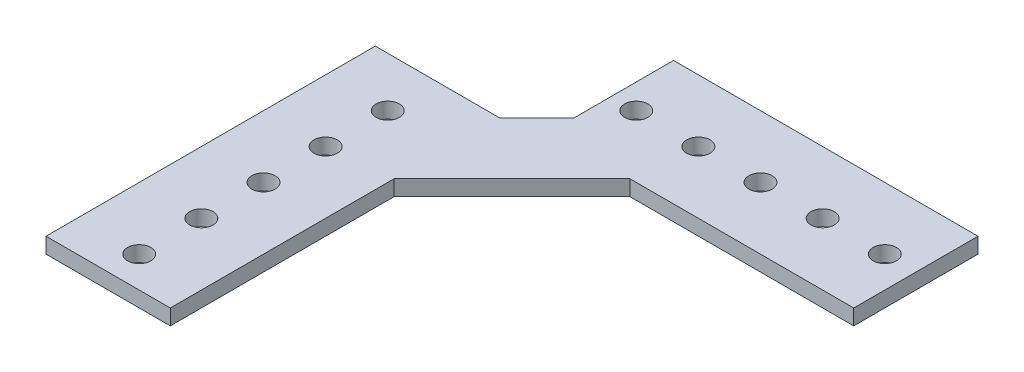
ISO-10303-21;
HEADER;
FILE_DESCRIPTION(('STEP AP214'),'2;1');
FILE_NAME('part.step','',(''),(''),'','','');
FILE_SCHEMA(('AUTOMOTIVE_DESIGN { 1 0 10303 214 1 1 1 1 }'));
ENDSEC;
DATA;
#1=APPLICATION_CONTEXT('core data for automotive mechanical design processes');
#2=APPLICATION_PROTOCOL_DEFINITION('international standard','automotive_design',2000,#1);
#3=PRODUCT_CONTEXT('',#1,'mechanical');
#4=PRODUCT('Part','Part','',(#3));
#5=PRODUCT_RELATED_PRODUCT_CATEGORY('part','',(#4));
#6=PRODUCT_DEFINITION_FORMATION('','',#4);
#7=PRODUCT_DEFINITION_CONTEXT('part definition',#1,'design');
#8=PRODUCT_DEFINITION('design','',#6,#7);
#9=PRODUCT_DEFINITION_SHAPE('','',#8);
#10=(LENGTH_UNIT() NAMED_UNIT(*) SI_UNIT(.MILLI.,.METRE.));
#11=(NAMED_UNIT(*) PLANE_ANGLE_UNIT() SI_UNIT($,.RADIAN.));
#12=(NAMED_UNIT(*) SI_UNIT($,.STERADIAN.) SOLID_ANGLE_UNIT());
#13=UNCERTAINTY_MEASURE_WITH_UNIT(LENGTH_MEASURE(1.E-05),#10,'distance_accuracy_value','');
#14=(GEOMETRIC_REPRESENTATION_CONTEXT(3) GLOBAL_UNCERTAINTY_ASSIGNED_CONTEXT((#13)) GLOBAL_UNIT_ASSIGNED_CONTEXT((#10,
#11,#12)) REPRESENTATION_CONTEXT('',''));
#15=CARTESIAN_POINT('',(0.,0.,0.));
#16=DIRECTION('',(0.,0.,1.));
#17=DIRECTION('',(1.,0.,0.));
#18=AXIS2_PLACEMENT_3D('',#15,#16,#17);
#19=CARTESIAN_POINT('',(0.,3.175,0.));
#20=DIRECTION('',(-1.,0.,0.));
#21=DIRECTION('',(0.,0.,1.));
#22=AXIS2_PLACEMENT_3D('',#19,#20,#21);
#23=PLANE('',#22);
#24=DIRECTION('',(0.,0.,-1.));
#25=VECTOR('',#24,1.);
#26=CARTESIAN_POINT('',(0.,0.,0.));
#27=LINE('',#26,#25);
#28=CARTESIAN_POINT('',(0.,0.,0.));
#29=VERTEX_POINT('',#28);
#30=CARTESIAN_POINT('',(0.,0.,-67.31));
#31=VERTEX_POINT('',#30);
#32=EDGE_CURVE('E129',#29,#31,#27,.T.);
#33=ORIENTED_EDGE('',*,*,#32,.F.);
#34=DIRECTION('',(0.,-1.,0.));
#35=VECTOR('',#34,1.);
#36=CARTESIAN_POINT('',(0.,3.175,0.));
#37=LINE('',#36,#35);
#38=CARTESIAN_POINT('',(0.,3.175,0.));
#39=VERTEX_POINT('',#38);
#40=EDGE_CURVE('E131',#39,#29,#37,.T.);
#41=ORIENTED_EDGE('',*,*,#40,.F.);
#42=DIRECTION('',(0.,0.,-1.));
#43=VECTOR('',#42,1.);
#44=CARTESIAN_POINT('',(0.,3.175,0.));
#45=LINE('',#44,#43);
#46=CARTESIAN_POINT('',(0.,3.175,-67.31));
#47=VERTEX_POINT('',#46);
#48=EDGE_CURVE('E275',#39,#47,#45,.T.);
#49=ORIENTED_EDGE('',*,*,#48,.T.);
#50=DIRECTION('',(0.,-1.,0.));
#51=VECTOR('',#50,1.);
#52=CARTESIAN_POINT('',(0.,3.175,-67.31));
#53=LINE('',#52,#51);
#54=EDGE_CURVE('E82',#47,#31,#53,.T.);
#55=ORIENTED_EDGE('',*,*,#54,.T.);
#56=EDGE_LOOP('',(#33,#41,#49,#55));
#57=FACE_BOUND('',#56,.T.);
#58=ADVANCED_FACE('F62',(#57),#23,.T.);
#59=CARTESIAN_POINT('',(25.4,3.175,0.));
#60=DIRECTION('',(-1.,0.,0.));
#61=DIRECTION('',(0.,0.,1.));
#62=AXIS2_PLACEMENT_3D('',#59,#60,#61);
#63=PLANE('',#62);
#64=DIRECTION('',(0.,0.,-1.));
#65=VECTOR('',#64,1.);
#66=CARTESIAN_POINT('',(25.4,0.,0.));
#67=LINE('',#66,#65);
#68=CARTESIAN_POINT('',(25.4,0.,0.));
#69=VERTEX_POINT('',#68);
#70=CARTESIAN_POINT('',(25.4,0.,-45.757385309434));
#71=VERTEX_POINT('',#70);
#72=EDGE_CURVE('E123',#69,#71,#67,.T.);
#73=ORIENTED_EDGE('',*,*,#72,.T.);
#74=DIRECTION('',(0.,-1.,0.));
#75=VECTOR('',#74,1.);
#76=CARTESIAN_POINT('',(25.4,3.175,-45.757385309434));
#77=LINE('',#76,#75);
#78=CARTESIAN_POINT('',(25.4,3.175,-45.757385309434));
#79=VERTEX_POINT('',#78);
#80=EDGE_CURVE('E12',#79,#71,#77,.T.);
#81=ORIENTED_EDGE('',*,*,#80,.F.);
#82=DIRECTION('',(0.,0.,-1.));
#83=VECTOR('',#82,1.);
#84=CARTESIAN_POINT('',(25.4,3.175,0.));
#85=LINE('',#84,#83);
#86=CARTESIAN_POINT('',(25.4,3.175,0.));
#87=VERTEX_POINT('',#86);
#88=EDGE_CURVE('E271',#87,#79,#85,.T.);
#89=ORIENTED_EDGE('',*,*,#88,.F.);
#90=DIRECTION('',(0.,-1.,0.));
#91=VECTOR('',#90,1.);
#92=CARTESIAN_POINT('',(25.4,3.175,0.));
#93=LINE('',#92,#91);
#94=EDGE_CURVE('E66',#87,#69,#93,.T.);
#95=ORIENTED_EDGE('',*,*,#94,.T.);
#96=EDGE_LOOP('',(#73,#81,#89,#95));
#97=FACE_BOUND('',#96,.T.);
#98=ADVANCED_FACE('F525',(#97),#63,.F.);
#99=CARTESIAN_POINT('',(-10.178692654717,3.175,-10.178692654717));
#100=DIRECTION('',(-0.707106781186548,0.,-0.707106781186548));
#101=DIRECTION('',(-0.707106781186548,0.,0.707106781186548));
#102=AXIS2_PLACEMENT_3D('',#99,#100,#101);
#103=PLANE('',#102);
#104=DIRECTION('',(0.707106781186548,0.,-0.707106781186548));
#105=VECTOR('',#104,1.);
#106=CARTESIAN_POINT('',(-10.178692654717,0.,-10.178692654717));
#107=LINE('',#106,#105);
#108=CARTESIAN_POINT('',(49.492614690566,0.,-69.8500000000001));
#109=VERTEX_POINT('',#108);
#110=EDGE_CURVE('E204',#71,#109,#107,.T.);
#111=ORIENTED_EDGE('',*,*,#110,.T.);
#112=DIRECTION('',(0.,-1.,0.));
#113=VECTOR('',#112,1.);
#114=CARTESIAN_POINT('',(49.492614690566,3.175,-69.8500000000001));
#115=LINE('',#114,#113);
#116=CARTESIAN_POINT('',(49.492614690566,3.175,-69.8500000000001));
#117=VERTEX_POINT('',#116);
#118=EDGE_CURVE('E73',#117,#109,#115,.T.);
#119=ORIENTED_EDGE('',*,*,#118,.F.);
#120=DIRECTION('',(0.707106781186548,0.,-0.707106781186548));
#121=VECTOR('',#120,1.);
#122=CARTESIAN_POINT('',(-10.178692654717,3.175,-10.178692654717));
#123=LINE('',#122,#121);
#124=EDGE_CURVE('E267',#79,#117,#123,.T.);
#125=ORIENTED_EDGE('',*,*,#124,.F.);
#126=ORIENTED_EDGE('',*,*,#80,.T.);
#127=EDGE_LOOP('',(#111,#119,#125,#126));
#128=FACE_BOUND('',#127,.T.);
#129=ADVANCED_FACE('F516',(#128),#103,.F.);
#130=CARTESIAN_POINT('',(0.,3.175,-69.8500000000001));
#131=DIRECTION('',(0.,0.,-1.));
#132=DIRECTION('',(-1.,0.,0.));
#133=AXIS2_PLACEMENT_3D('',#130,#131,#132);
#134=PLANE('',#133);
#135=DIRECTION('',(1.,0.,0.));
#136=VECTOR('',#135,1.);
#137=CARTESIAN_POINT('',(0.,0.,-69.8500000000001));
#138=LINE('',#137,#136);
#139=CARTESIAN_POINT('',(95.2499999999999,0.,-69.8500000000001));
#140=VERTEX_POINT('',#139);
#141=EDGE_CURVE('E200',#109,#140,#138,.T.);
#142=ORIENTED_EDGE('',*,*,#141,.T.);
#143=DIRECTION('',(0.,-1.,0.));
#144=VECTOR('',#143,1.);
#145=CARTESIAN_POINT('',(95.2499999999999,3.175,-69.8500000000001));
#146=LINE('',#145,#144);
#147=CARTESIAN_POINT('',(95.2499999999999,3.175,-69.8500000000001));
#148=VERTEX_POINT('',#147);
#149=EDGE_CURVE('E162',#148,#140,#146,.T.);
#150=ORIENTED_EDGE('',*,*,#149,.F.);
#151=DIRECTION('',(1.,0.,0.));
#152=VECTOR('',#151,1.);
#153=CARTESIAN_POINT('',(0.,3.175,-69.8500000000001));
#154=LINE('',#153,#152);
#155=EDGE_CURVE('E263',#117,#148,#154,.T.);
#156=ORIENTED_EDGE('',*,*,#155,.F.);
#157=ORIENTED_EDGE('',*,*,#118,.T.);
#158=EDGE_LOOP('',(#142,#150,#156,#157));
#159=FACE_BOUND('',#158,.T.);
#160=ADVANCED_FACE('F507',(#159),#134,.F.);
#161=CARTESIAN_POINT('',(95.2499999999999,3.175,0.));
#162=DIRECTION('',(1.,0.,0.));
#163=DIRECTION('',(0.,0.,-1.));
#164=AXIS2_PLACEMENT_3D('',#161,#162,#163);
#165=PLANE('',#164);
#166=DIRECTION('',(0.,0.,1.));
#167=VECTOR('',#166,1.);
#168=CARTESIAN_POINT('',(95.2499999999999,0.,0.));
#169=LINE('',#168,#167);
#170=CARTESIAN_POINT('',(95.2499999999999,0.,-95.2500000000002));
#171=VERTEX_POINT('',#170);
#172=EDGE_CURVE('E196',#171,#140,#169,.T.);
#173=ORIENTED_EDGE('',*,*,#172,.F.);
#174=DIRECTION('',(0.,-1.,0.));
#175=VECTOR('',#174,1.);
#176=CARTESIAN_POINT('',(95.2499999999999,3.175,-95.2500000000002));
#177=LINE('',#176,#175);
#178=CARTESIAN_POINT('',(95.2499999999999,3.175,-95.2500000000002));
#179=VERTEX_POINT('',#178);
#180=EDGE_CURVE('E165',#179,#171,#177,.T.);
#181=ORIENTED_EDGE('',*,*,#180,.F.);
#182=DIRECTION('',(0.,0.,1.));
#183=VECTOR('',#182,1.);
#184=CARTESIAN_POINT('',(95.2499999999999,3.175,0.));
#185=LINE('',#184,#183);
#186=EDGE_CURVE('E259',#179,#148,#185,.T.);
#187=ORIENTED_EDGE('',*,*,#186,.T.);
#188=ORIENTED_EDGE('',*,*,#149,.T.);
#189=EDGE_LOOP('',(#173,#181,#187,#188));
#190=FACE_BOUND('',#189,.T.);
#191=ADVANCED_FACE('F497',(#190),#165,.T.);
#192=CARTESIAN_POINT('',(0.,3.175,-95.2500000000002));
#193=DIRECTION('',(0.,0.,-1.));
#194=DIRECTION('',(-1.,0.,0.));
#195=AXIS2_PLACEMENT_3D('',#192,#193,#194);
#196=PLANE('',#195);
#197=DIRECTION('',(1.,0.,0.));
#198=VECTOR('',#197,1.);
#199=CARTESIAN_POINT('',(0.,0.,-95.2500000000002));
#200=LINE('',#199,#198);
#201=CARTESIAN_POINT('',(33.02,0.,-95.2500000000002));
#202=VERTEX_POINT('',#201);
#203=EDGE_CURVE('E192',#202,#171,#200,.T.);
#204=ORIENTED_EDGE('',*,*,#203,.F.);
#205=DIRECTION('',(0.,-1.,0.));
#206=VECTOR('',#205,1.);
#207=CARTESIAN_POINT('',(33.02,3.175,-95.2500000000002));
#208=LINE('',#207,#206);
#209=CARTESIAN_POINT('',(33.02,3.175,-95.2500000000002));
#210=VERTEX_POINT('',#209);
#211=EDGE_CURVE('E168',#210,#202,#208,.T.);
#212=ORIENTED_EDGE('',*,*,#211,.F.);
#213=DIRECTION('',(1.,0.,0.));
#214=VECTOR('',#213,1.);
#215=CARTESIAN_POINT('',(0.,3.175,-95.2500000000002));
#216=LINE('',#215,#214);
#217=EDGE_CURVE('E255',#210,#179,#216,.T.);
#218=ORIENTED_EDGE('',*,*,#217,.T.);
#219=ORIENTED_EDGE('',*,*,#180,.T.);
#220=EDGE_LOOP('',(#204,#212,#218,#219));
#221=FACE_BOUND('',#220,.T.);
#222=ADVANCED_FACE('F487',(#221),#196,.T.);
#223=CARTESIAN_POINT('',(33.02,3.175,0.));
#224=DIRECTION('',(1.,0.,0.));
#225=DIRECTION('',(0.,0.,-1.));
#226=AXIS2_PLACEMENT_3D('',#223,#224,#225);
#227=PLANE('',#226);
#228=DIRECTION('',(0.,0.,1.));
#229=VECTOR('',#228,1.);
#230=CARTESIAN_POINT('',(33.02,0.,0.));
#231=LINE('',#230,#229);
#232=CARTESIAN_POINT('',(33.02,0.,-74.93));
#233=VERTEX_POINT('',#232);
#234=EDGE_CURVE('E188',#202,#233,#231,.T.);
#235=ORIENTED_EDGE('',*,*,#234,.T.);
#236=DIRECTION('',(0.,-1.,0.));
#237=VECTOR('',#236,1.);
#238=CARTESIAN_POINT('',(33.02,3.175,-74.93));
#239=LINE('',#238,#237);
#240=CARTESIAN_POINT('',(33.02,3.175,-74.93));
#241=VERTEX_POINT('',#240);
#242=EDGE_CURVE('E171',#241,#233,#239,.T.);
#243=ORIENTED_EDGE('',*,*,#242,.F.);
#244=DIRECTION('',(0.,0.,1.));
#245=VECTOR('',#244,1.);
#246=CARTESIAN_POINT('',(33.02,3.175,0.));
#247=LINE('',#246,#245);
#248=EDGE_CURVE('E251',#210,#241,#247,.T.);
#249=ORIENTED_EDGE('',*,*,#248,.F.);
#250=ORIENTED_EDGE('',*,*,#211,.T.);
#251=EDGE_LOOP('',(#235,#243,#249,#250));
#252=FACE_BOUND('',#251,.T.);
#253=ADVANCED_FACE('F477',(#252),#227,.F.);
#254=CARTESIAN_POINT('',(-20.955,3.175,-20.9550000000001));
#255=DIRECTION('',(-0.707106781186547,0.,-0.707106781186548));
#256=DIRECTION('',(-0.707106781186548,0.,0.707106781186547));
#257=AXIS2_PLACEMENT_3D('',#254,#255,#256);
#258=PLANE('',#257);
#259=DIRECTION('',(0.707106781186548,0.,-0.707106781186547));
#260=VECTOR('',#259,1.);
#261=CARTESIAN_POINT('',(-20.955,0.,-20.9550000000001));
#262=LINE('',#261,#260);
#263=CARTESIAN_POINT('',(25.4,0.,-67.31));
#264=VERTEX_POINT('',#263);
#265=EDGE_CURVE('E184',#264,#233,#262,.T.);
#266=ORIENTED_EDGE('',*,*,#265,.F.);
#267=DIRECTION('',(0.,-1.,0.));
#268=VECTOR('',#267,1.);
#269=CARTESIAN_POINT('',(25.4,3.175,-67.31));
#270=LINE('',#269,#268);
#271=CARTESIAN_POINT('',(25.4,3.175,-67.31));
#272=VERTEX_POINT('',#271);
#273=EDGE_CURVE('E174',#272,#264,#270,.T.);
#274=ORIENTED_EDGE('',*,*,#273,.F.);
#275=DIRECTION('',(0.707106781186548,0.,-0.707106781186547));
#276=VECTOR('',#275,1.);
#277=CARTESIAN_POINT('',(-20.955,3.175,-20.9550000000001));
#278=LINE('',#277,#276);
#279=EDGE_CURVE('E247',#272,#241,#278,.T.);
#280=ORIENTED_EDGE('',*,*,#279,.T.);
#281=ORIENTED_EDGE('',*,*,#242,.T.);
#282=EDGE_LOOP('',(#266,#274,#280,#281));
#283=FACE_BOUND('',#282,.T.);
#284=ADVANCED_FACE('F467',(#283),#258,.T.);
#285=CARTESIAN_POINT('',(38.0999999999999,3.175,-82.5500000000002));
#286=DIRECTION('',(0.,-1.,0.));
#287=DIRECTION('',(0.,0.,-1.));
#288=AXIS2_PLACEMENT_3D('',#285,#286,#287);
#289=CYLINDRICAL_SURFACE('',#288,2.38125);
#290=CARTESIAN_POINT('',(38.0999999999999,3.175,-82.5500000000002));
#291=DIRECTION('',(0.,1.,0.));
#292=DIRECTION('',(0.,0.,1.));
#293=AXIS2_PLACEMENT_3D('',#290,#291,#292);
#294=CIRCLE('',#293,2.38125);
#295=CARTESIAN_POINT('',(38.0999999999999,3.175,-80.1687500000002));
#296=VERTEX_POINT('',#295);
#297=EDGE_CURVE('E278',#296,#296,#294,.T.);
#298=ORIENTED_EDGE('',*,*,#297,.T.);
#299=EDGE_LOOP('',(#298));
#300=FACE_BOUND('',#299,.T.);
#301=CARTESIAN_POINT('',(38.0999999999999,0.,-82.5500000000002));
#302=DIRECTION('',(0.,1.,0.));
#303=DIRECTION('',(0.,0.,1.));
#304=AXIS2_PLACEMENT_3D('',#301,#302,#303);
#305=CIRCLE('',#304,2.38125);
#306=CARTESIAN_POINT('',(38.0999999999999,0.,-80.1687500000002));
#307=VERTEX_POINT('',#306);
#308=EDGE_CURVE('E135',#307,#307,#305,.T.);
#309=ORIENTED_EDGE('',*,*,#308,.F.);
#310=EDGE_LOOP('',(#309));
#311=FACE_BOUND('',#310,.T.);
#312=ADVANCED_FACE('F457',(#300,#311),#289,.F.);
#313=CARTESIAN_POINT('',(50.7999999999999,3.175,-82.5500000000002));
#314=DIRECTION('',(0.,-1.,0.));
#315=DIRECTION('',(0.,0.,-1.));
#316=AXIS2_PLACEMENT_3D('',#313,#314,#315);
#317=CYLINDRICAL_SURFACE('',#316,2.38125);
#318=CARTESIAN_POINT('',(50.7999999999999,3.175,-82.5500000000002));
#319=DIRECTION('',(0.,1.,0.));
#320=DIRECTION('',(0.,0.,1.));
#321=AXIS2_PLACEMENT_3D('',#318,#319,#320);
#322=CIRCLE('',#321,2.38125);
#323=CARTESIAN_POINT('',(50.7999999999999,3.175,-80.1687500000002));
#324=VERTEX_POINT('',#323);
#325=EDGE_CURVE('E282',#324,#324,#322,.T.);
#326=ORIENTED_EDGE('',*,*,#325,.T.);
#327=EDGE_LOOP('',(#326));
#328=FACE_BOUND('',#327,.T.);
#329=CARTESIAN_POINT('',(50.7999999999999,0.,-82.5500000000002));
#330=DIRECTION('',(0.,1.,0.));
#331=DIRECTION('',(0.,0.,1.));
#332=AXIS2_PLACEMENT_3D('',#329,#330,#331);
#333=CIRCLE('',#332,2.38125);
#334=CARTESIAN_POINT('',(50.7999999999999,0.,-80.1687500000002));
#335=VERTEX_POINT('',#334);
#336=EDGE_CURVE('E213',#335,#335,#333,.T.);
#337=ORIENTED_EDGE('',*,*,#336,.F.);
#338=EDGE_LOOP('',(#337));
#339=FACE_BOUND('',#338,.T.);
#340=ADVANCED_FACE('F447',(#328,#339),#317,.F.);
#341=CARTESIAN_POINT('',(63.4999999999999,3.175,-82.5500000000002));
#342=DIRECTION('',(0.,-1.,0.));
#343=DIRECTION('',(0.,0.,-1.));
#344=AXIS2_PLACEMENT_3D('',#341,#342,#343);
#345=CYLINDRICAL_SURFACE('',#344,2.38125);
#346=CARTESIAN_POINT('',(63.4999999999999,3.175,-82.5500000000002));
#347=DIRECTION('',(0.,1.,0.));
#348=DIRECTION('',(0.,0.,1.));
#349=AXIS2_PLACEMENT_3D('',#346,#347,#348);
#350=CIRCLE('',#349,2.38125);
#351=CARTESIAN_POINT('',(63.4999999999999,3.175,-80.1687500000002));
#352=VERTEX_POINT('',#351);
#353=EDGE_CURVE('E286',#352,#352,#350,.T.);
#354=ORIENTED_EDGE('',*,*,#353,.T.);
#355=EDGE_LOOP('',(#354));
#356=FACE_BOUND('',#355,.T.);
#357=CARTESIAN_POINT('',(63.4999999999999,0.,-82.5500000000002));
#358=DIRECTION('',(0.,1.,0.));
#359=DIRECTION('',(0.,0.,1.));
#360=AXIS2_PLACEMENT_3D('',#357,#358,#359);
#361=CIRCLE('',#360,2.38125);
#362=CARTESIAN_POINT('',(63.4999999999999,0.,-80.1687500000002));
#363=VERTEX_POINT('',#362);
#364=EDGE_CURVE('E217',#363,#363,#361,.T.);
#365=ORIENTED_EDGE('',*,*,#364,.F.);
#366=EDGE_LOOP('',(#365));
#367=FACE_BOUND('',#366,.T.);
#368=ADVANCED_FACE('F437',(#356,#367),#345,.F.);
#369=CARTESIAN_POINT('',(12.7,3.175,-57.15));
#370=DIRECTION('',(0.,-1.,0.));
#371=DIRECTION('',(0.,0.,-1.));
#372=AXIS2_PLACEMENT_3D('',#369,#370,#371);
#373=CYLINDRICAL_SURFACE('',#372,2.38125);
#374=CARTESIAN_POINT('',(12.7,3.175,-57.15));
#375=DIRECTION('',(0.,1.,0.));
#376=DIRECTION('',(0.,0.,1.));
#377=AXIS2_PLACEMENT_3D('',#374,#375,#376);
#378=CIRCLE('',#377,2.38125);
#379=CARTESIAN_POINT('',(12.7,3.175,-54.76875));
#380=VERTEX_POINT('',#379);
#381=EDGE_CURVE('E290',#380,#380,#378,.T.);
#382=ORIENTED_EDGE('',*,*,#381,.T.);
#383=EDGE_LOOP('',(#382));
#384=FACE_BOUND('',#383,.T.);
#385=CARTESIAN_POINT('',(12.7,0.,-57.15));
#386=DIRECTION('',(0.,1.,0.));
#387=DIRECTION('',(0.,0.,1.));
#388=AXIS2_PLACEMENT_3D('',#385,#386,#387);
#389=CIRCLE('',#388,2.38125);
#390=CARTESIAN_POINT('',(12.7,0.,-54.76875));
#391=VERTEX_POINT('',#390);
#392=EDGE_CURVE('E221',#391,#391,#389,.T.);
#393=ORIENTED_EDGE('',*,*,#392,.F.);
#394=EDGE_LOOP('',(#393));
#395=FACE_BOUND('',#394,.T.);
#396=ADVANCED_FACE('F427',(#384,#395),#373,.F.);
#397=CARTESIAN_POINT('',(12.7,3.175,-44.45));
#398=DIRECTION('',(0.,-1.,0.));
#399=DIRECTION('',(0.,0.,-1.));
#400=AXIS2_PLACEMENT_3D('',#397,#398,#399);
#401=CYLINDRICAL_SURFACE('',#400,2.38125);
#402=CARTESIAN_POINT('',(12.7,3.175,-44.45));
#403=DIRECTION('',(0.,1.,0.));
#404=DIRECTION('',(0.,0.,1.));
#405=AXIS2_PLACEMENT_3D('',#402,#403,#404);
#406=CIRCLE('',#405,2.38125);
#407=CARTESIAN_POINT('',(12.7,3.175,-42.06875));
#408=VERTEX_POINT('',#407);
#409=EDGE_CURVE('E294',#408,#408,#406,.T.);
#410=ORIENTED_EDGE('',*,*,#409,.T.);
#411=EDGE_LOOP('',(#410));
#412=FACE_BOUND('',#411,.T.);
#413=CARTESIAN_POINT('',(12.7,0.,-44.45));
#414=DIRECTION('',(0.,1.,0.));
#415=DIRECTION('',(0.,0.,1.));
#416=AXIS2_PLACEMENT_3D('',#413,#414,#415);
#417=CIRCLE('',#416,2.38125);
#418=CARTESIAN_POINT('',(12.7,0.,-42.06875));
#419=VERTEX_POINT('',#418);
#420=EDGE_CURVE('E225',#419,#419,#417,.T.);
#421=ORIENTED_EDGE('',*,*,#420,.F.);
#422=EDGE_LOOP('',(#421));
#423=FACE_BOUND('',#422,.T.);
#424=ADVANCED_FACE('F417',(#412,#423),#401,.F.);
#425=CARTESIAN_POINT('',(12.7,3.175,-31.75));
#426=DIRECTION('',(0.,-1.,0.));
#427=DIRECTION('',(0.,0.,-1.));
#428=AXIS2_PLACEMENT_3D('',#425,#426,#427);
#429=CYLINDRICAL_SURFACE('',#428,2.38125);
#430=CARTESIAN_POINT('',(12.7,3.175,-31.75));
#431=DIRECTION('',(0.,1.,0.));
#432=DIRECTION('',(0.,0.,1.));
#433=AXIS2_PLACEMENT_3D('',#430,#431,#432);
#434=CIRCLE('',#433,2.38125);
#435=CARTESIAN_POINT('',(12.7,3.175,-29.36875));
#436=VERTEX_POINT('',#435);
#437=EDGE_CURVE('E298',#436,#436,#434,.T.);
#438=ORIENTED_EDGE('',*,*,#437,.T.);
#439=EDGE_LOOP('',(#438));
#440=FACE_BOUND('',#439,.T.);
#441=CARTESIAN_POINT('',(12.7,0.,-31.75));
#442=DIRECTION('',(0.,1.,0.));
#443=DIRECTION('',(0.,0.,1.));
#444=AXIS2_PLACEMENT_3D('',#441,#442,#443);
#445=CIRCLE('',#444,2.38125);
#446=CARTESIAN_POINT('',(12.7,0.,-29.36875));
#447=VERTEX_POINT('',#446);
#448=EDGE_CURVE('E229',#447,#447,#445,.T.);
#449=ORIENTED_EDGE('',*,*,#448,.F.);
#450=EDGE_LOOP('',(#449));
#451=FACE_BOUND('',#450,.T.);
#452=ADVANCED_FACE('F407',(#440,#451),#429,.F.);
#453=CARTESIAN_POINT('',(12.7,3.175,-19.05));
#454=DIRECTION('',(0.,-1.,0.));
#455=DIRECTION('',(0.,0.,-1.));
#456=AXIS2_PLACEMENT_3D('',#453,#454,#455);
#457=CYLINDRICAL_SURFACE('',#456,2.38125);
#458=CARTESIAN_POINT('',(12.7,3.175,-19.05));
#459=DIRECTION('',(0.,1.,0.));
#460=DIRECTION('',(0.,0.,1.));
#461=AXIS2_PLACEMENT_3D('',#458,#459,#460);
#462=CIRCLE('',#461,2.38125);
#463=CARTESIAN_POINT('',(12.7,3.175,-16.66875));
#464=VERTEX_POINT('',#463);
#465=EDGE_CURVE('E302',#464,#464,#462,.T.);
#466=ORIENTED_EDGE('',*,*,#465,.T.);
#467=EDGE_LOOP('',(#466));
#468=FACE_BOUND('',#467,.T.);
#469=CARTESIAN_POINT('',(12.7,0.,-19.05));
#470=DIRECTION('',(0.,1.,0.));
#471=DIRECTION('',(0.,0.,1.));
#472=AXIS2_PLACEMENT_3D('',#469,#470,#471);
#473=CIRCLE('',#472,2.38125);
#474=CARTESIAN_POINT('',(12.7,0.,-16.66875));
#475=VERTEX_POINT('',#474);
#476=EDGE_CURVE('E233',#475,#475,#473,.T.);
#477=ORIENTED_EDGE('',*,*,#476,.F.);
#478=EDGE_LOOP('',(#477));
#479=FACE_BOUND('',#478,.T.);
#480=ADVANCED_FACE('F397',(#468,#479),#457,.F.);
#481=CARTESIAN_POINT('',(76.1999999999999,3.175,-82.5500000000002));
#482=DIRECTION('',(0.,-1.,0.));
#483=DIRECTION('',(0.,0.,-1.));
#484=AXIS2_PLACEMENT_3D('',#481,#482,#483);
#485=CYLINDRICAL_SURFACE('',#484,2.38125);
#486=CARTESIAN_POINT('',(76.1999999999999,3.175,-82.5500000000002));
#487=DIRECTION('',(0.,1.,0.));
#488=DIRECTION('',(0.,0.,1.));
#489=AXIS2_PLACEMENT_3D('',#486,#487,#488);
#490=CIRCLE('',#489,2.38125);
#491=CARTESIAN_POINT('',(76.1999999999999,3.175,-80.1687500000002));
#492=VERTEX_POINT('',#491);
#493=EDGE_CURVE('E306',#492,#492,#490,.T.);
#494=ORIENTED_EDGE('',*,*,#493,.T.);
#495=EDGE_LOOP('',(#494));
#496=FACE_BOUND('',#495,.T.);
#497=CARTESIAN_POINT('',(76.1999999999999,0.,-82.5500000000002));
#498=DIRECTION('',(0.,1.,0.));
#499=DIRECTION('',(0.,0.,1.));
#500=AXIS2_PLACEMENT_3D('',#497,#498,#499);
#501=CIRCLE('',#500,2.38125);
#502=CARTESIAN_POINT('',(76.1999999999999,0.,-80.1687500000002));
#503=VERTEX_POINT('',#502);
#504=EDGE_CURVE('E237',#503,#503,#501,.T.);
#505=ORIENTED_EDGE('',*,*,#504,.F.);
#506=EDGE_LOOP('',(#505));
#507=FACE_BOUND('',#506,.T.);
#508=ADVANCED_FACE('F388',(#496,#507),#485,.F.);
#509=CARTESIAN_POINT('',(88.8999999999999,3.175,-82.5500000000002));
#510=DIRECTION('',(0.,-1.,0.));
#511=DIRECTION('',(0.,0.,-1.));
#512=AXIS2_PLACEMENT_3D('',#509,#510,#511);
#513=CYLINDRICAL_SURFACE('',#512,2.38125);
#514=CARTESIAN_POINT('',(88.8999999999999,3.175,-82.5500000000002));
#515=DIRECTION('',(0.,1.,0.));
#516=DIRECTION('',(0.,0.,1.));
#517=AXIS2_PLACEMENT_3D('',#514,#515,#516);
#518=CIRCLE('',#517,2.38125);
#519=CARTESIAN_POINT('',(88.8999999999999,3.175,-80.1687500000002));
#520=VERTEX_POINT('',#519);
#521=EDGE_CURVE('E183',#520,#520,#518,.T.);
#522=ORIENTED_EDGE('',*,*,#521,.T.);
#523=EDGE_LOOP('',(#522));
#524=FACE_BOUND('',#523,.T.);
#525=CARTESIAN_POINT('',(88.8999999999999,0.,-82.5500000000002));
#526=DIRECTION('',(0.,1.,0.));
#527=DIRECTION('',(0.,0.,1.));
#528=AXIS2_PLACEMENT_3D('',#525,#526,#527);
#529=CIRCLE('',#528,2.38125);
#530=CARTESIAN_POINT('',(88.8999999999999,0.,-80.1687500000002));
#531=VERTEX_POINT('',#530);
#532=EDGE_CURVE('E241',#531,#531,#529,.T.);
#533=ORIENTED_EDGE('',*,*,#532,.F.);
#534=EDGE_LOOP('',(#533));
#535=FACE_BOUND('',#534,.T.);
#536=ADVANCED_FACE('F314',(#524,#535),#513,.F.);
#537=CARTESIAN_POINT('',(0.,3.175,-67.31));
#538=DIRECTION('',(0.,0.,-1.));
#539=DIRECTION('',(-1.,0.,0.));
#540=AXIS2_PLACEMENT_3D('',#537,#538,#539);
#541=PLANE('',#540);
#542=DIRECTION('',(1.,0.,0.));
#543=VECTOR('',#542,1.);
#544=CARTESIAN_POINT('',(0.,0.,-67.31));
#545=LINE('',#544,#543);
#546=EDGE_CURVE('E180',#31,#264,#545,.T.);
#547=ORIENTED_EDGE('',*,*,#546,.F.);
#548=ORIENTED_EDGE('',*,*,#54,.F.);
#549=DIRECTION('',(1.,0.,0.));
#550=VECTOR('',#549,1.);
#551=CARTESIAN_POINT('',(0.,3.175,-67.31));
#552=LINE('',#551,#550);
#553=EDGE_CURVE('E179',#47,#272,#552,.T.);
#554=ORIENTED_EDGE('',*,*,#553,.T.);
#555=ORIENTED_EDGE('',*,*,#273,.T.);
#556=EDGE_LOOP('',(#547,#548,#554,#555));
#557=FACE_BOUND('',#556,.T.);
#558=ADVANCED_FACE('F320',(#557),#541,.T.);
#559=CARTESIAN_POINT('',(0.,3.175,0.));
#560=DIRECTION('',(0.,1.,0.));
#561=DIRECTION('',(0.,0.,1.));
#562=AXIS2_PLACEMENT_3D('',#559,#560,#561);
#563=PLANE('',#562);
#564=ORIENTED_EDGE('',*,*,#521,.F.);
#565=EDGE_LOOP('',(#564));
#566=FACE_BOUND('',#565,.T.);
#567=ORIENTED_EDGE('',*,*,#493,.F.);
#568=EDGE_LOOP('',(#567));
#569=FACE_BOUND('',#568,.T.);
#570=ORIENTED_EDGE('',*,*,#465,.F.);
#571=EDGE_LOOP('',(#570));
#572=FACE_BOUND('',#571,.T.);
#573=ORIENTED_EDGE('',*,*,#437,.F.);
#574=EDGE_LOOP('',(#573));
#575=FACE_BOUND('',#574,.T.);
#576=ORIENTED_EDGE('',*,*,#409,.F.);
#577=EDGE_LOOP('',(#576));
#578=FACE_BOUND('',#577,.T.);
#579=ORIENTED_EDGE('',*,*,#381,.F.);
#580=EDGE_LOOP('',(#579));
#581=FACE_BOUND('',#580,.T.);
#582=ORIENTED_EDGE('',*,*,#353,.F.);
#583=EDGE_LOOP('',(#582));
#584=FACE_BOUND('',#583,.T.);
#585=ORIENTED_EDGE('',*,*,#325,.F.);
#586=EDGE_LOOP('',(#585));
#587=FACE_BOUND('',#586,.T.);
#588=ORIENTED_EDGE('',*,*,#297,.F.);
#589=EDGE_LOOP('',(#588));
#590=FACE_BOUND('',#589,.T.);
#591=ORIENTED_EDGE('',*,*,#48,.F.);
#592=DIRECTION('',(1.,0.,0.));
#593=VECTOR('',#592,1.);
#594=CARTESIAN_POINT('',(0.,3.175,0.));
#595=LINE('',#594,#593);
#596=EDGE_CURVE('E142',#39,#87,#595,.T.);
#597=ORIENTED_EDGE('',*,*,#596,.T.);
#598=ORIENTED_EDGE('',*,*,#88,.T.);
#599=ORIENTED_EDGE('',*,*,#124,.T.);
#600=ORIENTED_EDGE('',*,*,#155,.T.);
#601=ORIENTED_EDGE('',*,*,#186,.F.);
#602=ORIENTED_EDGE('',*,*,#217,.F.);
#603=ORIENTED_EDGE('',*,*,#248,.T.);
#604=ORIENTED_EDGE('',*,*,#279,.F.);
#605=ORIENTED_EDGE('',*,*,#553,.F.);
#606=EDGE_LOOP('',(#591,#597,#598,#599,#600,#601,#602,#603,#604,#605));
#607=FACE_BOUND('',#606,.T.);
#608=CARTESIAN_POINT('',(12.7,3.175,-6.35));
#609=DIRECTION('',(0.,1.,0.));
#610=DIRECTION('',(0.,0.,1.));
#611=AXIS2_PLACEMENT_3D('',#608,#609,#610);
#612=CIRCLE('',#611,2.38125);
#613=CARTESIAN_POINT('',(12.7,3.175,-3.96875));
#614=VERTEX_POINT('',#613);
#615=EDGE_CURVE('E147',#614,#614,#612,.T.);
#616=ORIENTED_EDGE('',*,*,#615,.F.);
#617=EDGE_LOOP('',(#616));
#618=FACE_BOUND('',#617,.T.);
#619=ADVANCED_FACE('F317',(#566,#569,#572,#575,#578,#581,#584,#587,#590,#607,#618),#563,.T.);
#620=CARTESIAN_POINT('',(0.,0.,0.));
#621=DIRECTION('',(0.,1.,0.));
#622=DIRECTION('',(0.,0.,1.));
#623=AXIS2_PLACEMENT_3D('',#620,#621,#622);
#624=PLANE('',#623);
#625=ORIENTED_EDGE('',*,*,#532,.T.);
#626=EDGE_LOOP('',(#625));
#627=FACE_BOUND('',#626,.T.);
#628=ORIENTED_EDGE('',*,*,#504,.T.);
#629=EDGE_LOOP('',(#628));
#630=FACE_BOUND('',#629,.T.);
#631=ORIENTED_EDGE('',*,*,#476,.T.);
#632=EDGE_LOOP('',(#631));
#633=FACE_BOUND('',#632,.T.);
#634=ORIENTED_EDGE('',*,*,#448,.T.);
#635=EDGE_LOOP('',(#634));
#636=FACE_BOUND('',#635,.T.);
#637=ORIENTED_EDGE('',*,*,#420,.T.);
#638=EDGE_LOOP('',(#637));
#639=FACE_BOUND('',#638,.T.);
#640=ORIENTED_EDGE('',*,*,#392,.T.);
#641=EDGE_LOOP('',(#640));
#642=FACE_BOUND('',#641,.T.);
#643=ORIENTED_EDGE('',*,*,#364,.T.);
#644=EDGE_LOOP('',(#643));
#645=FACE_BOUND('',#644,.T.);
#646=ORIENTED_EDGE('',*,*,#336,.T.);
#647=EDGE_LOOP('',(#646));
#648=FACE_BOUND('',#647,.T.);
#649=ORIENTED_EDGE('',*,*,#308,.T.);
#650=EDGE_LOOP('',(#649));
#651=FACE_BOUND('',#650,.T.);
#652=ORIENTED_EDGE('',*,*,#32,.T.);
#653=ORIENTED_EDGE('',*,*,#546,.T.);
#654=ORIENTED_EDGE('',*,*,#265,.T.);
#655=ORIENTED_EDGE('',*,*,#234,.F.);
#656=ORIENTED_EDGE('',*,*,#203,.T.);
#657=ORIENTED_EDGE('',*,*,#172,.T.);
#658=ORIENTED_EDGE('',*,*,#141,.F.);
#659=ORIENTED_EDGE('',*,*,#110,.F.);
#660=ORIENTED_EDGE('',*,*,#72,.F.);
#661=DIRECTION('',(1.,0.,0.));
#662=VECTOR('',#661,1.);
#663=CARTESIAN_POINT('',(0.,0.,0.));
#664=LINE('',#663,#662);
#665=EDGE_CURVE('E140',#29,#69,#664,.T.);
#666=ORIENTED_EDGE('',*,*,#665,.F.);
#667=EDGE_LOOP('',(#652,#653,#654,#655,#656,#657,#658,#659,#660,#666));
#668=FACE_BOUND('',#667,.T.);
#669=CARTESIAN_POINT('',(12.7,0.,-6.35));
#670=DIRECTION('',(0.,1.,0.));
#671=DIRECTION('',(0.,0.,1.));
#672=AXIS2_PLACEMENT_3D('',#669,#670,#671);
#673=CIRCLE('',#672,2.38125);
#674=CARTESIAN_POINT('',(12.7,0.,-3.96875));
#675=VERTEX_POINT('',#674);
#676=EDGE_CURVE('E153',#675,#675,#673,.T.);
#677=ORIENTED_EDGE('',*,*,#676,.T.);
#678=EDGE_LOOP('',(#677));
#679=FACE_BOUND('',#678,.T.);
#680=ADVANCED_FACE('F144',(#627,#630,#633,#636,#639,#642,#645,#648,#651,#668,#679),#624,.F.);
#681=CARTESIAN_POINT('',(12.7,3.175,-6.35));
#682=DIRECTION('',(0.,-1.,0.));
#683=DIRECTION('',(0.,0.,-1.));
#684=AXIS2_PLACEMENT_3D('',#681,#682,#683);
#685=CYLINDRICAL_SURFACE('',#684,2.38125);
#686=ORIENTED_EDGE('',*,*,#615,.T.);
#687=EDGE_LOOP('',(#686));
#688=FACE_BOUND('',#687,.T.);
#689=ORIENTED_EDGE('',*,*,#676,.F.);
#690=EDGE_LOOP('',(#689));
#691=FACE_BOUND('',#690,.T.);
#692=ADVANCED_FACE('F342',(#688,#691),#685,.F.);
#693=CARTESIAN_POINT('',(0.,3.175,0.));
#694=DIRECTION('',(0.,0.,-1.));
#695=DIRECTION('',(-1.,0.,0.));
#696=AXIS2_PLACEMENT_3D('',#693,#694,#695);
#697=PLANE('',#696);
#698=ORIENTED_EDGE('',*,*,#665,.T.);
#699=ORIENTED_EDGE('',*,*,#94,.F.);
#700=ORIENTED_EDGE('',*,*,#596,.F.);
#701=ORIENTED_EDGE('',*,*,#40,.T.);
#702=EDGE_LOOP('',(#698,#699,#700,#701));
#703=FACE_BOUND('',#702,.T.);
#704=ADVANCED_FACE('F64',(#703),#697,.F.);
#705=CLOSED_SHELL('',(#58,#98,#129,#160,#191,#222,#253,#284,#312,#340,#368,#396,#424,#452,#480,
#508,#536,#558,#619,#680,#692,#704));
#706=MANIFOLD_SOLID_BREP('B2',#705);
#707=ADVANCED_BREP_SHAPE_REPRESENTATION('',(#18,#706),#14);
#708=SHAPE_DEFINITION_REPRESENTATION(#9,#707);
ENDSEC;
END-ISO-10303-21;
